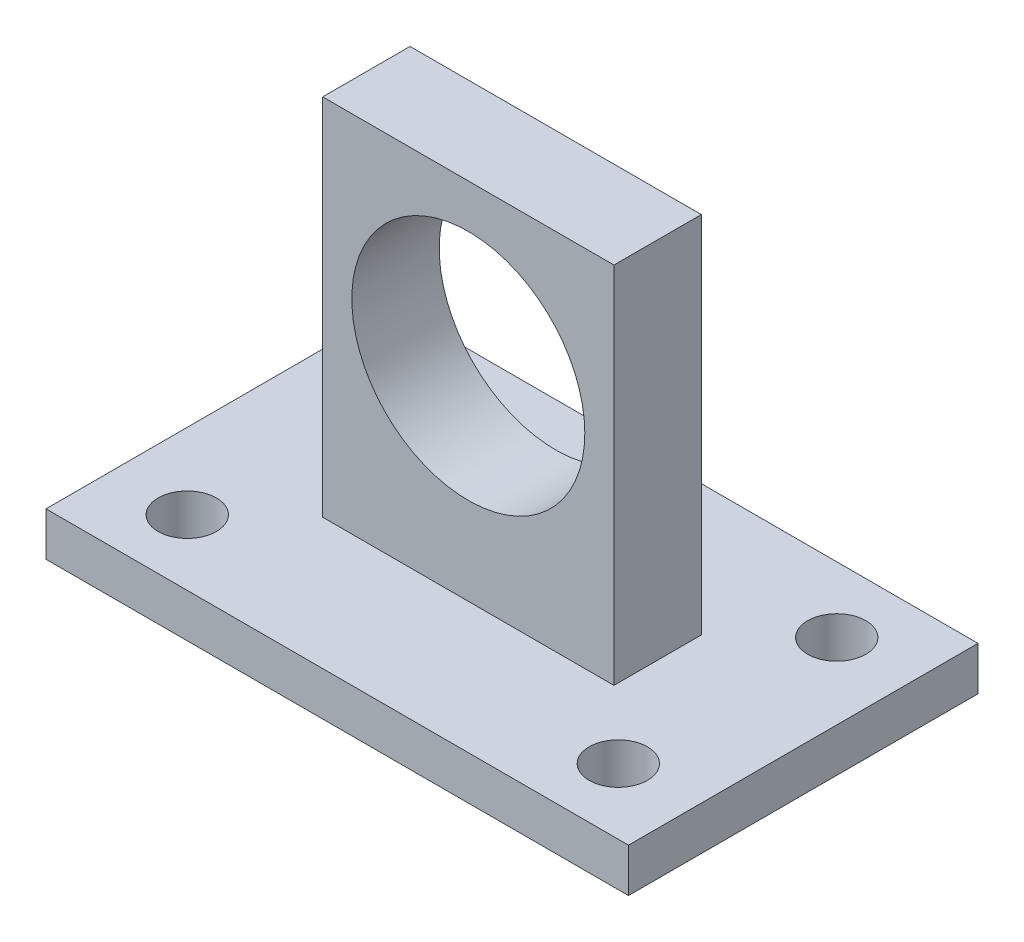
ISO-10303-21;
HEADER;
FILE_DESCRIPTION(('STEP AP214'),'2;1');
FILE_NAME('part.step','',(''),(''),'','','');
FILE_SCHEMA(('AUTOMOTIVE_DESIGN { 1 0 10303 214 1 1 1 1 }'));
ENDSEC;
DATA;
#1=APPLICATION_CONTEXT('core data for automotive mechanical design processes');
#2=APPLICATION_PROTOCOL_DEFINITION('international standard','automotive_design',2000,#1);
#3=PRODUCT_CONTEXT('',#1,'mechanical');
#4=PRODUCT('Part','Part','',(#3));
#5=PRODUCT_RELATED_PRODUCT_CATEGORY('part','',(#4));
#6=PRODUCT_DEFINITION_FORMATION('','',#4);
#7=PRODUCT_DEFINITION_CONTEXT('part definition',#1,'design');
#8=PRODUCT_DEFINITION('design','',#6,#7);
#9=PRODUCT_DEFINITION_SHAPE('','',#8);
#10=(LENGTH_UNIT() NAMED_UNIT(*) SI_UNIT(.MILLI.,.METRE.));
#11=(NAMED_UNIT(*) PLANE_ANGLE_UNIT() SI_UNIT($,.RADIAN.));
#12=(NAMED_UNIT(*) SI_UNIT($,.STERADIAN.) SOLID_ANGLE_UNIT());
#13=UNCERTAINTY_MEASURE_WITH_UNIT(LENGTH_MEASURE(1.E-05),#10,'distance_accuracy_value','');
#14=(GEOMETRIC_REPRESENTATION_CONTEXT(3) GLOBAL_UNCERTAINTY_ASSIGNED_CONTEXT((#13)) GLOBAL_UNIT_ASSIGNED_CONTEXT((#10,
#11,#12)) REPRESENTATION_CONTEXT('',''));
#15=CARTESIAN_POINT('',(0.,0.,0.));
#16=DIRECTION('',(0.,0.,1.));
#17=DIRECTION('',(1.,0.,0.));
#18=AXIS2_PLACEMENT_3D('',#15,#16,#17);
#19=CARTESIAN_POINT('',(0.,3.,0.));
#20=DIRECTION('',(0.,1.,0.));
#21=DIRECTION('',(0.,0.,1.));
#22=AXIS2_PLACEMENT_3D('',#19,#20,#21);
#23=PLANE('',#22);
#24=CARTESIAN_POINT('',(-14.8,3.,-7.5));
#25=DIRECTION('',(0.,1.,0.));
#26=DIRECTION('',(0.,0.,-1.));
#27=AXIS2_PLACEMENT_3D('',#24,#25,#26);
#28=CIRCLE('',#27,2.);
#29=CARTESIAN_POINT('',(-14.8,3.,-9.5));
#30=VERTEX_POINT('',#29);
#31=EDGE_CURVE('E156',#30,#30,#28,.T.);
#32=ORIENTED_EDGE('',*,*,#31,.F.);
#33=EDGE_LOOP('',(#32));
#34=FACE_BOUND('',#33,.T.);
#35=CARTESIAN_POINT('',(-14.8,3.,7.5));
#36=DIRECTION('',(0.,1.,0.));
#37=DIRECTION('',(0.,0.,1.));
#38=AXIS2_PLACEMENT_3D('',#35,#36,#37);
#39=CIRCLE('',#38,2.);
#40=CARTESIAN_POINT('',(-14.8,3.,9.5));
#41=VERTEX_POINT('',#40);
#42=EDGE_CURVE('E172',#41,#41,#39,.T.);
#43=ORIENTED_EDGE('',*,*,#42,.F.);
#44=EDGE_LOOP('',(#43));
#45=FACE_BOUND('',#44,.T.);
#46=DIRECTION('',(0.,0.,-1.));
#47=VECTOR('',#46,1.);
#48=CARTESIAN_POINT('',(20.,3.,-12.));
#49=LINE('',#48,#47);
#50=CARTESIAN_POINT('',(20.,3.,12.));
#51=VERTEX_POINT('',#50);
#52=CARTESIAN_POINT('',(20.,3.,-12.));
#53=VERTEX_POINT('',#52);
#54=EDGE_CURVE('E180',#51,#53,#49,.T.);
#55=ORIENTED_EDGE('',*,*,#54,.T.);
#56=DIRECTION('',(-1.,0.,0.));
#57=VECTOR('',#56,1.);
#58=CARTESIAN_POINT('',(-20.,3.,-12.));
#59=LINE('',#58,#57);
#60=CARTESIAN_POINT('',(-20.,3.,-12.));
#61=VERTEX_POINT('',#60);
#62=EDGE_CURVE('E92',#53,#61,#59,.T.);
#63=ORIENTED_EDGE('',*,*,#62,.T.);
#64=DIRECTION('',(0.,0.,1.));
#65=VECTOR('',#64,1.);
#66=CARTESIAN_POINT('',(-20.,3.,-12.));
#67=LINE('',#66,#65);
#68=CARTESIAN_POINT('',(-20.,3.,12.));
#69=VERTEX_POINT('',#68);
#70=EDGE_CURVE('E185',#61,#69,#67,.T.);
#71=ORIENTED_EDGE('',*,*,#70,.T.);
#72=DIRECTION('',(1.,0.,0.));
#73=VECTOR('',#72,1.);
#74=CARTESIAN_POINT('',(-20.,3.,12.));
#75=LINE('',#74,#73);
#76=EDGE_CURVE('E64',#69,#51,#75,.T.);
#77=ORIENTED_EDGE('',*,*,#76,.T.);
#78=EDGE_LOOP('',(#55,#63,#71,#77));
#79=FACE_BOUND('',#78,.T.);
#80=CARTESIAN_POINT('',(14.8,3.,7.5));
#81=DIRECTION('',(0.,1.,0.));
#82=DIRECTION('',(0.,0.,-1.));
#83=AXIS2_PLACEMENT_3D('',#80,#81,#82);
#84=CIRCLE('',#83,2.);
#85=CARTESIAN_POINT('',(14.8,3.,5.5));
#86=VERTEX_POINT('',#85);
#87=EDGE_CURVE('E164',#86,#86,#84,.T.);
#88=ORIENTED_EDGE('',*,*,#87,.F.);
#89=EDGE_LOOP('',(#88));
#90=FACE_BOUND('',#89,.T.);
#91=CARTESIAN_POINT('',(14.8,3.,-7.5));
#92=DIRECTION('',(0.,1.,0.));
#93=DIRECTION('',(0.,0.,1.));
#94=AXIS2_PLACEMENT_3D('',#91,#92,#93);
#95=CIRCLE('',#94,2.);
#96=CARTESIAN_POINT('',(14.8,3.,-5.5));
#97=VERTEX_POINT('',#96);
#98=EDGE_CURVE('E147',#97,#97,#95,.T.);
#99=ORIENTED_EDGE('',*,*,#98,.F.);
#100=EDGE_LOOP('',(#99));
#101=FACE_BOUND('',#100,.T.);
#102=DIRECTION('',(0.,0.,1.));
#103=VECTOR('',#102,1.);
#104=CARTESIAN_POINT('',(-10.,3.,-3.));
#105=LINE('',#104,#103);
#106=CARTESIAN_POINT('',(-10.,3.,-3.));
#107=VERTEX_POINT('',#106);
#108=CARTESIAN_POINT('',(-10.,3.,3.));
#109=VERTEX_POINT('',#108);
#110=EDGE_CURVE('E284',#107,#109,#105,.T.);
#111=ORIENTED_EDGE('',*,*,#110,.F.);
#112=DIRECTION('',(-1.,0.,0.));
#113=VECTOR('',#112,1.);
#114=CARTESIAN_POINT('',(-10.,3.,-3.));
#115=LINE('',#114,#113);
#116=CARTESIAN_POINT('',(10.,3.,-3.));
#117=VERTEX_POINT('',#116);
#118=EDGE_CURVE('E139',#117,#107,#115,.T.);
#119=ORIENTED_EDGE('',*,*,#118,.F.);
#120=DIRECTION('',(0.,0.,-1.));
#121=VECTOR('',#120,1.);
#122=CARTESIAN_POINT('',(10.,3.,-3.));
#123=LINE('',#122,#121);
#124=CARTESIAN_POINT('',(10.,3.,3.));
#125=VERTEX_POINT('',#124);
#126=EDGE_CURVE('E135',#125,#117,#123,.T.);
#127=ORIENTED_EDGE('',*,*,#126,.F.);
#128=DIRECTION('',(1.,0.,0.));
#129=VECTOR('',#128,1.);
#130=CARTESIAN_POINT('',(-10.,3.,3.));
#131=LINE('',#130,#129);
#132=EDGE_CURVE('E295',#109,#125,#131,.T.);
#133=ORIENTED_EDGE('',*,*,#132,.F.);
#134=EDGE_LOOP('',(#111,#119,#127,#133));
#135=FACE_BOUND('',#134,.T.);
#136=ADVANCED_FACE('F39',(#34,#45,#79,#90,#101,#135),#23,.T.);
#137=CARTESIAN_POINT('',(0.,0.,0.));
#138=DIRECTION('',(0.,1.,0.));
#139=DIRECTION('',(0.,0.,1.));
#140=AXIS2_PLACEMENT_3D('',#137,#138,#139);
#141=PLANE('',#140);
#142=DIRECTION('',(0.,0.,-1.));
#143=VECTOR('',#142,1.);
#144=CARTESIAN_POINT('',(20.,0.,-12.));
#145=LINE('',#144,#143);
#146=CARTESIAN_POINT('',(20.,0.,12.));
#147=VERTEX_POINT('',#146);
#148=CARTESIAN_POINT('',(20.,0.,-12.));
#149=VERTEX_POINT('',#148);
#150=EDGE_CURVE('E176',#147,#149,#145,.T.);
#151=ORIENTED_EDGE('',*,*,#150,.F.);
#152=DIRECTION('',(1.,0.,0.));
#153=VECTOR('',#152,1.);
#154=CARTESIAN_POINT('',(-20.,0.,12.));
#155=LINE('',#154,#153);
#156=CARTESIAN_POINT('',(-20.,0.,12.));
#157=VERTEX_POINT('',#156);
#158=EDGE_CURVE('E85',#157,#147,#155,.T.);
#159=ORIENTED_EDGE('',*,*,#158,.F.);
#160=DIRECTION('',(0.,0.,1.));
#161=VECTOR('',#160,1.);
#162=CARTESIAN_POINT('',(-20.,0.,-12.));
#163=LINE('',#162,#161);
#164=CARTESIAN_POINT('',(-20.,0.,-12.));
#165=VERTEX_POINT('',#164);
#166=EDGE_CURVE('E197',#165,#157,#163,.T.);
#167=ORIENTED_EDGE('',*,*,#166,.F.);
#168=DIRECTION('',(-1.,0.,0.));
#169=VECTOR('',#168,1.);
#170=CARTESIAN_POINT('',(-20.,0.,-12.));
#171=LINE('',#170,#169);
#172=EDGE_CURVE('E194',#149,#165,#171,.T.);
#173=ORIENTED_EDGE('',*,*,#172,.F.);
#174=EDGE_LOOP('',(#151,#159,#167,#173));
#175=FACE_BOUND('',#174,.T.);
#176=CARTESIAN_POINT('',(-14.8,0.,7.5));
#177=DIRECTION('',(0.,1.,0.));
#178=DIRECTION('',(0.,0.,1.));
#179=AXIS2_PLACEMENT_3D('',#176,#177,#178);
#180=CIRCLE('',#179,2.);
#181=CARTESIAN_POINT('',(-14.8,0.,9.5));
#182=VERTEX_POINT('',#181);
#183=EDGE_CURVE('E168',#182,#182,#180,.T.);
#184=ORIENTED_EDGE('',*,*,#183,.T.);
#185=EDGE_LOOP('',(#184));
#186=FACE_BOUND('',#185,.T.);
#187=CARTESIAN_POINT('',(14.8,0.,7.5));
#188=DIRECTION('',(0.,1.,0.));
#189=DIRECTION('',(0.,0.,-1.));
#190=AXIS2_PLACEMENT_3D('',#187,#188,#189);
#191=CIRCLE('',#190,2.);
#192=CARTESIAN_POINT('',(14.8,0.,5.5));
#193=VERTEX_POINT('',#192);
#194=EDGE_CURVE('E160',#193,#193,#191,.T.);
#195=ORIENTED_EDGE('',*,*,#194,.T.);
#196=EDGE_LOOP('',(#195));
#197=FACE_BOUND('',#196,.T.);
#198=CARTESIAN_POINT('',(-14.8,0.,-7.5));
#199=DIRECTION('',(0.,1.,0.));
#200=DIRECTION('',(0.,0.,-1.));
#201=AXIS2_PLACEMENT_3D('',#198,#199,#200);
#202=CIRCLE('',#201,2.);
#203=CARTESIAN_POINT('',(-14.8,0.,-9.5));
#204=VERTEX_POINT('',#203);
#205=EDGE_CURVE('E154',#204,#204,#202,.T.);
#206=ORIENTED_EDGE('',*,*,#205,.T.);
#207=EDGE_LOOP('',(#206));
#208=FACE_BOUND('',#207,.T.);
#209=CARTESIAN_POINT('',(14.8,0.,-7.5));
#210=DIRECTION('',(0.,1.,0.));
#211=DIRECTION('',(0.,0.,1.));
#212=AXIS2_PLACEMENT_3D('',#209,#210,#211);
#213=CIRCLE('',#212,2.);
#214=CARTESIAN_POINT('',(14.8,0.,-5.5));
#215=VERTEX_POINT('',#214);
#216=EDGE_CURVE('E142',#215,#215,#213,.T.);
#217=ORIENTED_EDGE('',*,*,#216,.T.);
#218=EDGE_LOOP('',(#217));
#219=FACE_BOUND('',#218,.T.);
#220=ADVANCED_FACE('F215',(#175,#186,#197,#208,#219),#141,.F.);
#221=CARTESIAN_POINT('',(20.,3.,-12.));
#222=DIRECTION('',(-1.,0.,0.));
#223=DIRECTION('',(0.,0.,1.));
#224=AXIS2_PLACEMENT_3D('',#221,#222,#223);
#225=PLANE('',#224);
#226=ORIENTED_EDGE('',*,*,#150,.T.);
#227=DIRECTION('',(0.,-1.,0.));
#228=VECTOR('',#227,1.);
#229=CARTESIAN_POINT('',(20.,3.,-12.));
#230=LINE('',#229,#228);
#231=EDGE_CURVE('E11',#53,#149,#230,.T.);
#232=ORIENTED_EDGE('',*,*,#231,.F.);
#233=ORIENTED_EDGE('',*,*,#54,.F.);
#234=DIRECTION('',(0.,-1.,0.));
#235=VECTOR('',#234,1.);
#236=CARTESIAN_POINT('',(20.,3.,12.));
#237=LINE('',#236,#235);
#238=EDGE_CURVE('E190',#51,#147,#237,.T.);
#239=ORIENTED_EDGE('',*,*,#238,.T.);
#240=EDGE_LOOP('',(#226,#232,#233,#239));
#241=FACE_BOUND('',#240,.T.);
#242=ADVANCED_FACE('F41',(#241),#225,.F.);
#243=CARTESIAN_POINT('',(-20.,3.,-12.));
#244=DIRECTION('',(0.,0.,1.));
#245=DIRECTION('',(1.,0.,0.));
#246=AXIS2_PLACEMENT_3D('',#243,#244,#245);
#247=PLANE('',#246);
#248=ORIENTED_EDGE('',*,*,#172,.T.);
#249=DIRECTION('',(0.,-1.,0.));
#250=VECTOR('',#249,1.);
#251=CARTESIAN_POINT('',(-20.,3.,-12.));
#252=LINE('',#251,#250);
#253=EDGE_CURVE('E48',#61,#165,#252,.T.);
#254=ORIENTED_EDGE('',*,*,#253,.F.);
#255=ORIENTED_EDGE('',*,*,#62,.F.);
#256=ORIENTED_EDGE('',*,*,#231,.T.);
#257=EDGE_LOOP('',(#248,#254,#255,#256));
#258=FACE_BOUND('',#257,.T.);
#259=ADVANCED_FACE('F231',(#258),#247,.F.);
#260=CARTESIAN_POINT('',(-20.,3.,-12.));
#261=DIRECTION('',(1.,0.,0.));
#262=DIRECTION('',(0.,0.,-1.));
#263=AXIS2_PLACEMENT_3D('',#260,#261,#262);
#264=PLANE('',#263);
#265=ORIENTED_EDGE('',*,*,#166,.T.);
#266=DIRECTION('',(0.,-1.,0.));
#267=VECTOR('',#266,1.);
#268=CARTESIAN_POINT('',(-20.,3.,12.));
#269=LINE('',#268,#267);
#270=EDGE_CURVE('E204',#69,#157,#269,.T.);
#271=ORIENTED_EDGE('',*,*,#270,.F.);
#272=ORIENTED_EDGE('',*,*,#70,.F.);
#273=ORIENTED_EDGE('',*,*,#253,.T.);
#274=EDGE_LOOP('',(#265,#271,#272,#273));
#275=FACE_BOUND('',#274,.T.);
#276=ADVANCED_FACE('F211',(#275),#264,.F.);
#277=CARTESIAN_POINT('',(-20.,3.,12.));
#278=DIRECTION('',(0.,0.,-1.));
#279=DIRECTION('',(-1.,0.,0.));
#280=AXIS2_PLACEMENT_3D('',#277,#278,#279);
#281=PLANE('',#280);
#282=ORIENTED_EDGE('',*,*,#158,.T.);
#283=ORIENTED_EDGE('',*,*,#238,.F.);
#284=ORIENTED_EDGE('',*,*,#76,.F.);
#285=ORIENTED_EDGE('',*,*,#270,.T.);
#286=EDGE_LOOP('',(#282,#283,#284,#285));
#287=FACE_BOUND('',#286,.T.);
#288=ADVANCED_FACE('F220',(#287),#281,.F.);
#289=CARTESIAN_POINT('',(-14.8,3.,7.5));
#290=DIRECTION('',(0.,-1.,0.));
#291=DIRECTION('',(0.,0.,-1.));
#292=AXIS2_PLACEMENT_3D('',#289,#290,#291);
#293=CYLINDRICAL_SURFACE('',#292,2.);
#294=ORIENTED_EDGE('',*,*,#42,.T.);
#295=EDGE_LOOP('',(#294));
#296=FACE_BOUND('',#295,.T.);
#297=ORIENTED_EDGE('',*,*,#183,.F.);
#298=EDGE_LOOP('',(#297));
#299=FACE_BOUND('',#298,.T.);
#300=ADVANCED_FACE('F222',(#296,#299),#293,.F.);
#301=CARTESIAN_POINT('',(14.8,3.,7.5));
#302=DIRECTION('',(0.,-1.,0.));
#303=DIRECTION('',(0.,0.,-1.));
#304=AXIS2_PLACEMENT_3D('',#301,#302,#303);
#305=CYLINDRICAL_SURFACE('',#304,2.);
#306=ORIENTED_EDGE('',*,*,#87,.T.);
#307=EDGE_LOOP('',(#306));
#308=FACE_BOUND('',#307,.T.);
#309=ORIENTED_EDGE('',*,*,#194,.F.);
#310=EDGE_LOOP('',(#309));
#311=FACE_BOUND('',#310,.T.);
#312=ADVANCED_FACE('F228',(#308,#311),#305,.F.);
#313=CARTESIAN_POINT('',(-14.8,3.,-7.5));
#314=DIRECTION('',(0.,-1.,0.));
#315=DIRECTION('',(0.,0.,-1.));
#316=AXIS2_PLACEMENT_3D('',#313,#314,#315);
#317=CYLINDRICAL_SURFACE('',#316,2.);
#318=ORIENTED_EDGE('',*,*,#31,.T.);
#319=EDGE_LOOP('',(#318));
#320=FACE_BOUND('',#319,.T.);
#321=ORIENTED_EDGE('',*,*,#205,.F.);
#322=EDGE_LOOP('',(#321));
#323=FACE_BOUND('',#322,.T.);
#324=ADVANCED_FACE('F245',(#320,#323),#317,.F.);
#325=CARTESIAN_POINT('',(14.8,3.,-7.5));
#326=DIRECTION('',(0.,-1.,0.));
#327=DIRECTION('',(0.,0.,-1.));
#328=AXIS2_PLACEMENT_3D('',#325,#326,#327);
#329=CYLINDRICAL_SURFACE('',#328,2.);
#330=ORIENTED_EDGE('',*,*,#98,.T.);
#331=EDGE_LOOP('',(#330));
#332=FACE_BOUND('',#331,.T.);
#333=ORIENTED_EDGE('',*,*,#216,.F.);
#334=EDGE_LOOP('',(#333));
#335=FACE_BOUND('',#334,.T.);
#336=ADVANCED_FACE('F249',(#332,#335),#329,.F.);
#337=CARTESIAN_POINT('',(-10.,28.,-3.));
#338=DIRECTION('',(0.,0.,1.));
#339=DIRECTION('',(1.,0.,0.));
#340=AXIS2_PLACEMENT_3D('',#337,#338,#339);
#341=PLANE('',#340);
#342=CARTESIAN_POINT('',(0.,17.,-3.));
#343=DIRECTION('',(0.,0.,1.));
#344=DIRECTION('',(1.,0.,0.));
#345=AXIS2_PLACEMENT_3D('',#342,#343,#344);
#346=CIRCLE('',#345,8.);
#347=CARTESIAN_POINT('',(8.,17.,-3.));
#348=VERTEX_POINT('',#347);
#349=EDGE_CURVE('E279',#348,#348,#346,.T.);
#350=ORIENTED_EDGE('',*,*,#349,.T.);
#351=EDGE_LOOP('',(#350));
#352=FACE_BOUND('',#351,.T.);
#353=ORIENTED_EDGE('',*,*,#118,.T.);
#354=DIRECTION('',(0.,-1.,0.));
#355=VECTOR('',#354,1.);
#356=CARTESIAN_POINT('',(-10.,28.,-3.));
#357=LINE('',#356,#355);
#358=CARTESIAN_POINT('',(-10.,28.,-3.));
#359=VERTEX_POINT('',#358);
#360=EDGE_CURVE('E118',#359,#107,#357,.T.);
#361=ORIENTED_EDGE('',*,*,#360,.F.);
#362=DIRECTION('',(-1.,0.,0.));
#363=VECTOR('',#362,1.);
#364=CARTESIAN_POINT('',(-10.,28.,-3.));
#365=LINE('',#364,#363);
#366=CARTESIAN_POINT('',(10.,28.,-3.));
#367=VERTEX_POINT('',#366);
#368=EDGE_CURVE('E126',#367,#359,#365,.T.);
#369=ORIENTED_EDGE('',*,*,#368,.F.);
#370=DIRECTION('',(0.,-1.,0.));
#371=VECTOR('',#370,1.);
#372=CARTESIAN_POINT('',(10.,28.,-3.));
#373=LINE('',#372,#371);
#374=EDGE_CURVE('E291',#367,#117,#373,.T.);
#375=ORIENTED_EDGE('',*,*,#374,.T.);
#376=EDGE_LOOP('',(#353,#361,#369,#375));
#377=FACE_BOUND('',#376,.T.);
#378=ADVANCED_FACE('F137',(#352,#377),#341,.F.);
#379=CARTESIAN_POINT('',(-10.,28.,-3.));
#380=DIRECTION('',(1.,0.,0.));
#381=DIRECTION('',(0.,0.,-1.));
#382=AXIS2_PLACEMENT_3D('',#379,#380,#381);
#383=PLANE('',#382);
#384=ORIENTED_EDGE('',*,*,#110,.T.);
#385=DIRECTION('',(0.,-1.,0.));
#386=VECTOR('',#385,1.);
#387=CARTESIAN_POINT('',(-10.,28.,3.));
#388=LINE('',#387,#386);
#389=CARTESIAN_POINT('',(-10.,28.,3.));
#390=VERTEX_POINT('',#389);
#391=EDGE_CURVE('E121',#390,#109,#388,.T.);
#392=ORIENTED_EDGE('',*,*,#391,.F.);
#393=DIRECTION('',(0.,0.,1.));
#394=VECTOR('',#393,1.);
#395=CARTESIAN_POINT('',(-10.,28.,-3.));
#396=LINE('',#395,#394);
#397=EDGE_CURVE('E114',#359,#390,#396,.T.);
#398=ORIENTED_EDGE('',*,*,#397,.F.);
#399=ORIENTED_EDGE('',*,*,#360,.T.);
#400=EDGE_LOOP('',(#384,#392,#398,#399));
#401=FACE_BOUND('',#400,.T.);
#402=ADVANCED_FACE('F116',(#401),#383,.F.);
#403=CARTESIAN_POINT('',(-10.,28.,3.));
#404=DIRECTION('',(0.,0.,-1.));
#405=DIRECTION('',(-1.,0.,0.));
#406=AXIS2_PLACEMENT_3D('',#403,#404,#405);
#407=PLANE('',#406);
#408=CARTESIAN_POINT('',(0.,17.,3.));
#409=DIRECTION('',(0.,0.,1.));
#410=DIRECTION('',(1.,0.,0.));
#411=AXIS2_PLACEMENT_3D('',#408,#409,#410);
#412=CIRCLE('',#411,8.);
#413=CARTESIAN_POINT('',(8.,17.,3.));
#414=VERTEX_POINT('',#413);
#415=EDGE_CURVE('E276',#414,#414,#412,.T.);
#416=ORIENTED_EDGE('',*,*,#415,.F.);
#417=EDGE_LOOP('',(#416));
#418=FACE_BOUND('',#417,.T.);
#419=ORIENTED_EDGE('',*,*,#132,.T.);
#420=DIRECTION('',(0.,-1.,0.));
#421=VECTOR('',#420,1.);
#422=CARTESIAN_POINT('',(10.,28.,3.));
#423=LINE('',#422,#421);
#424=CARTESIAN_POINT('',(10.,28.,3.));
#425=VERTEX_POINT('',#424);
#426=EDGE_CURVE('E55',#425,#125,#423,.T.);
#427=ORIENTED_EDGE('',*,*,#426,.F.);
#428=DIRECTION('',(1.,0.,0.));
#429=VECTOR('',#428,1.);
#430=CARTESIAN_POINT('',(-10.,28.,3.));
#431=LINE('',#430,#429);
#432=EDGE_CURVE('E125',#390,#425,#431,.T.);
#433=ORIENTED_EDGE('',*,*,#432,.F.);
#434=ORIENTED_EDGE('',*,*,#391,.T.);
#435=EDGE_LOOP('',(#419,#427,#433,#434));
#436=FACE_BOUND('',#435,.T.);
#437=ADVANCED_FACE('F259',(#418,#436),#407,.F.);
#438=CARTESIAN_POINT('',(10.,28.,-3.));
#439=DIRECTION('',(-1.,0.,0.));
#440=DIRECTION('',(0.,0.,1.));
#441=AXIS2_PLACEMENT_3D('',#438,#439,#440);
#442=PLANE('',#441);
#443=ORIENTED_EDGE('',*,*,#126,.T.);
#444=ORIENTED_EDGE('',*,*,#374,.F.);
#445=DIRECTION('',(0.,0.,-1.));
#446=VECTOR('',#445,1.);
#447=CARTESIAN_POINT('',(10.,28.,-3.));
#448=LINE('',#447,#446);
#449=EDGE_CURVE('E130',#425,#367,#448,.T.);
#450=ORIENTED_EDGE('',*,*,#449,.F.);
#451=ORIENTED_EDGE('',*,*,#426,.T.);
#452=EDGE_LOOP('',(#443,#444,#450,#451));
#453=FACE_BOUND('',#452,.T.);
#454=ADVANCED_FACE('F262',(#453),#442,.F.);
#455=CARTESIAN_POINT('',(0.,28.,0.));
#456=DIRECTION('',(0.,-1.,0.));
#457=DIRECTION('',(0.,0.,-1.));
#458=AXIS2_PLACEMENT_3D('',#455,#456,#457);
#459=PLANE('',#458);
#460=ORIENTED_EDGE('',*,*,#368,.T.);
#461=ORIENTED_EDGE('',*,*,#397,.T.);
#462=ORIENTED_EDGE('',*,*,#432,.T.);
#463=ORIENTED_EDGE('',*,*,#449,.T.);
#464=EDGE_LOOP('',(#460,#461,#462,#463));
#465=FACE_BOUND('',#464,.T.);
#466=ADVANCED_FACE('F129',(#465),#459,.F.);
#467=CARTESIAN_POINT('',(0.,17.,-7.));
#468=DIRECTION('',(0.,0.,1.));
#469=DIRECTION('',(1.,0.,0.));
#470=AXIS2_PLACEMENT_3D('',#467,#468,#469);
#471=CYLINDRICAL_SURFACE('',#470,8.);
#472=ORIENTED_EDGE('',*,*,#415,.T.);
#473=EDGE_LOOP('',(#472));
#474=FACE_BOUND('',#473,.T.);
#475=ORIENTED_EDGE('',*,*,#349,.F.);
#476=EDGE_LOOP('',(#475));
#477=FACE_BOUND('',#476,.T.);
#478=ADVANCED_FACE('F268',(#474,#477),#471,.F.);
#479=CLOSED_SHELL('',(#136,#220,#242,#259,#276,#288,#300,#312,#324,#336,#378,#402,#437,#454,
#466,#478));
#480=MANIFOLD_SOLID_BREP('B2',#479);
#481=ADVANCED_BREP_SHAPE_REPRESENTATION('',(#18,#480),#14);
#482=SHAPE_DEFINITION_REPRESENTATION(#9,#481);
ENDSEC;
END-ISO-10303-21;
